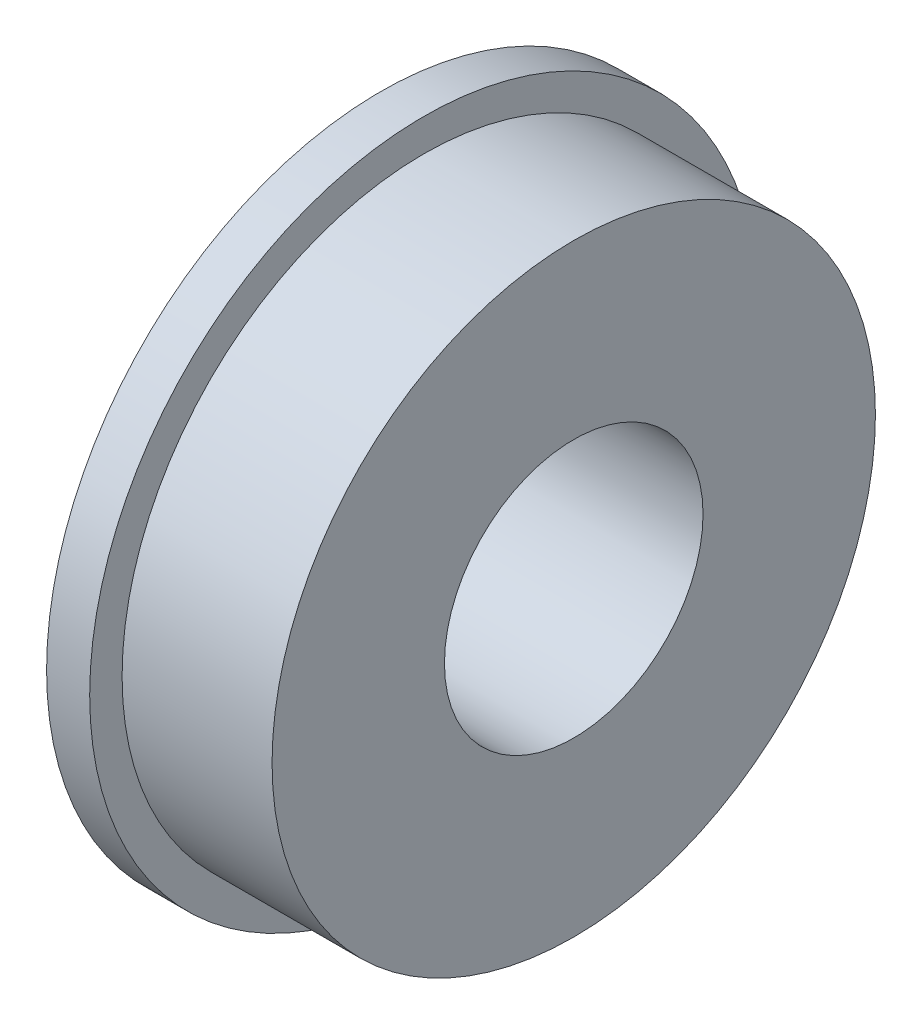
ISO-10303-21;
HEADER;
FILE_DESCRIPTION(('STEP AP214'),'2;1');
FILE_NAME('part.step','',(''),(''),'','','');
FILE_SCHEMA(('AUTOMOTIVE_DESIGN { 1 0 10303 214 1 1 1 1 }'));
ENDSEC;
DATA;
#1=APPLICATION_CONTEXT('core data for automotive mechanical design processes');
#2=APPLICATION_PROTOCOL_DEFINITION('international standard','automotive_design',2000,#1);
#3=PRODUCT_CONTEXT('',#1,'mechanical');
#4=PRODUCT('Part','Part','',(#3));
#5=PRODUCT_RELATED_PRODUCT_CATEGORY('part','',(#4));
#6=PRODUCT_DEFINITION_FORMATION('','',#4);
#7=PRODUCT_DEFINITION_CONTEXT('part definition',#1,'design');
#8=PRODUCT_DEFINITION('design','',#6,#7);
#9=PRODUCT_DEFINITION_SHAPE('','',#8);
#10=(LENGTH_UNIT() NAMED_UNIT(*) SI_UNIT(.MILLI.,.METRE.));
#11=(NAMED_UNIT(*) PLANE_ANGLE_UNIT() SI_UNIT($,.RADIAN.));
#12=(NAMED_UNIT(*) SI_UNIT($,.STERADIAN.) SOLID_ANGLE_UNIT());
#13=UNCERTAINTY_MEASURE_WITH_UNIT(LENGTH_MEASURE(1.E-05),#10,'distance_accuracy_value','');
#14=(GEOMETRIC_REPRESENTATION_CONTEXT(3) GLOBAL_UNCERTAINTY_ASSIGNED_CONTEXT((#13)) GLOBAL_UNIT_ASSIGNED_CONTEXT((#10,
#11,#12)) REPRESENTATION_CONTEXT('',''));
#15=CARTESIAN_POINT('',(0.,0.,0.));
#16=DIRECTION('',(0.,0.,1.));
#17=DIRECTION('',(1.,0.,0.));
#18=AXIS2_PLACEMENT_3D('',#15,#16,#17);
#19=CARTESIAN_POINT('',(0.,0.,0.));
#20=DIRECTION('',(-1.,0.,0.));
#21=DIRECTION('',(0.,0.,1.));
#22=AXIS2_PLACEMENT_3D('',#19,#20,#21);
#23=CYLINDRICAL_SURFACE('',#22,9.906);
#24=CARTESIAN_POINT('',(0.381,0.,0.));
#25=DIRECTION('',(-1.,0.,0.));
#26=DIRECTION('',(0.,0.,1.));
#27=AXIS2_PLACEMENT_3D('',#24,#25,#26);
#28=CIRCLE('',#27,9.906);
#29=CARTESIAN_POINT('',(0.381,0.,9.906));
#30=VERTEX_POINT('',#29);
#31=EDGE_CURVE('E46',#30,#30,#28,.F.);
#32=ORIENTED_EDGE('',*,*,#31,.T.);
#33=EDGE_LOOP('',(#32));
#34=FACE_BOUND('',#33,.T.);
#35=CARTESIAN_POINT('',(0.,0.,0.));
#36=DIRECTION('',(-1.,0.,0.));
#37=DIRECTION('',(0.,0.,1.));
#38=AXIS2_PLACEMENT_3D('',#35,#36,#37);
#39=CIRCLE('',#38,9.906);
#40=CARTESIAN_POINT('',(0.,0.,9.906));
#41=VERTEX_POINT('',#40);
#42=EDGE_CURVE('E18',#41,#41,#39,.T.);
#43=ORIENTED_EDGE('',*,*,#42,.T.);
#44=EDGE_LOOP('',(#43));
#45=FACE_BOUND('',#44,.T.);
#46=ADVANCED_FACE('F15',(#34,#45),#23,.F.);
#47=CARTESIAN_POINT('',(0.,12.3063,0.));
#48=DIRECTION('',(1.,0.,0.));
#49=DIRECTION('',(0.,0.,-1.));
#50=AXIS2_PLACEMENT_3D('',#47,#48,#49);
#51=PLANE('',#50);
#52=CARTESIAN_POINT('',(0.,0.,0.));
#53=DIRECTION('',(-1.,0.,0.));
#54=DIRECTION('',(0.,0.,1.));
#55=AXIS2_PLACEMENT_3D('',#52,#53,#54);
#56=CIRCLE('',#55,12.3063);
#57=CARTESIAN_POINT('',(0.,0.,12.3063));
#58=VERTEX_POINT('',#57);
#59=EDGE_CURVE('E44',#58,#58,#56,.F.);
#60=ORIENTED_EDGE('',*,*,#59,.F.);
#61=EDGE_LOOP('',(#60));
#62=FACE_BOUND('',#61,.T.);
#63=ORIENTED_EDGE('',*,*,#42,.F.);
#64=EDGE_LOOP('',(#63));
#65=FACE_BOUND('',#64,.T.);
#66=ADVANCED_FACE('F54',(#62,#65),#51,.F.);
#67=CARTESIAN_POINT('',(0.381,9.906,0.));
#68=DIRECTION('',(1.,0.,0.));
#69=DIRECTION('',(0.,0.,-1.));
#70=AXIS2_PLACEMENT_3D('',#67,#68,#69);
#71=PLANE('',#70);
#72=ORIENTED_EDGE('',*,*,#31,.F.);
#73=EDGE_LOOP('',(#72));
#74=FACE_BOUND('',#73,.T.);
#75=CARTESIAN_POINT('',(0.381,0.,0.));
#76=DIRECTION('',(-1.,0.,0.));
#77=DIRECTION('',(0.,0.,1.));
#78=AXIS2_PLACEMENT_3D('',#75,#76,#77);
#79=CIRCLE('',#78,6.35);
#80=CARTESIAN_POINT('',(0.381,0.,6.35));
#81=VERTEX_POINT('',#80);
#82=EDGE_CURVE('E41',#81,#81,#79,.T.);
#83=ORIENTED_EDGE('',*,*,#82,.F.);
#84=EDGE_LOOP('',(#83));
#85=FACE_BOUND('',#84,.T.);
#86=ADVANCED_FACE('F56',(#74,#85),#71,.F.);
#87=CARTESIAN_POINT('',(0.,0.,0.));
#88=DIRECTION('',(-1.,0.,0.));
#89=DIRECTION('',(0.,0.,1.));
#90=AXIS2_PLACEMENT_3D('',#87,#88,#89);
#91=CYLINDRICAL_SURFACE('',#90,12.3063);
#92=ORIENTED_EDGE('',*,*,#59,.T.);
#93=EDGE_LOOP('',(#92));
#94=FACE_BOUND('',#93,.T.);
#95=CARTESIAN_POINT('',(1.5875,0.,0.));
#96=DIRECTION('',(-1.,0.,0.));
#97=DIRECTION('',(0.,0.,1.));
#98=AXIS2_PLACEMENT_3D('',#95,#96,#97);
#99=CIRCLE('',#98,12.3063);
#100=CARTESIAN_POINT('',(1.5875,0.,12.3063));
#101=VERTEX_POINT('',#100);
#102=EDGE_CURVE('E38',#101,#101,#99,.T.);
#103=ORIENTED_EDGE('',*,*,#102,.T.);
#104=EDGE_LOOP('',(#103));
#105=FACE_BOUND('',#104,.T.);
#106=ADVANCED_FACE('F63',(#94,#105),#91,.T.);
#107=CARTESIAN_POINT('',(0.,0.,0.));
#108=DIRECTION('',(-1.,0.,0.));
#109=DIRECTION('',(0.,0.,1.));
#110=AXIS2_PLACEMENT_3D('',#107,#108,#109);
#111=CYLINDRICAL_SURFACE('',#110,6.35);
#112=CARTESIAN_POINT('',(0.,0.,0.));
#113=DIRECTION('',(-1.,0.,0.));
#114=DIRECTION('',(0.,0.,1.));
#115=AXIS2_PLACEMENT_3D('',#112,#113,#114);
#116=CIRCLE('',#115,6.35);
#117=CARTESIAN_POINT('',(0.,0.,6.35));
#118=VERTEX_POINT('',#117);
#119=EDGE_CURVE('E35',#118,#118,#116,.F.);
#120=ORIENTED_EDGE('',*,*,#119,.T.);
#121=EDGE_LOOP('',(#120));
#122=FACE_BOUND('',#121,.T.);
#123=ORIENTED_EDGE('',*,*,#82,.T.);
#124=EDGE_LOOP('',(#123));
#125=FACE_BOUND('',#124,.T.);
#126=ADVANCED_FACE('F89',(#122,#125),#111,.T.);
#127=CARTESIAN_POINT('',(1.5875,11.1125,0.));
#128=DIRECTION('',(-1.,0.,0.));
#129=DIRECTION('',(0.,0.,1.));
#130=AXIS2_PLACEMENT_3D('',#127,#128,#129);
#131=PLANE('',#130);
#132=CARTESIAN_POINT('',(1.5875,0.,0.));
#133=DIRECTION('',(-1.,0.,0.));
#134=DIRECTION('',(0.,0.,1.));
#135=AXIS2_PLACEMENT_3D('',#132,#133,#134);
#136=CIRCLE('',#135,11.1125);
#137=CARTESIAN_POINT('',(1.5875,0.,11.1125));
#138=VERTEX_POINT('',#137);
#139=EDGE_CURVE('E32',#138,#138,#136,.F.);
#140=ORIENTED_EDGE('',*,*,#139,.F.);
#141=EDGE_LOOP('',(#140));
#142=FACE_BOUND('',#141,.T.);
#143=ORIENTED_EDGE('',*,*,#102,.F.);
#144=EDGE_LOOP('',(#143));
#145=FACE_BOUND('',#144,.T.);
#146=ADVANCED_FACE('F85',(#142,#145),#131,.F.);
#147=CARTESIAN_POINT('',(0.,6.35,0.));
#148=DIRECTION('',(1.,0.,0.));
#149=DIRECTION('',(0.,0.,-1.));
#150=AXIS2_PLACEMENT_3D('',#147,#148,#149);
#151=PLANE('',#150);
#152=ORIENTED_EDGE('',*,*,#119,.F.);
#153=EDGE_LOOP('',(#152));
#154=FACE_BOUND('',#153,.T.);
#155=CARTESIAN_POINT('',(0.,0.,0.));
#156=DIRECTION('',(-1.,0.,0.));
#157=DIRECTION('',(0.,0.,1.));
#158=AXIS2_PLACEMENT_3D('',#155,#156,#157);
#159=CIRCLE('',#158,4.7625);
#160=CARTESIAN_POINT('',(0.,0.,4.7625));
#161=VERTEX_POINT('',#160);
#162=EDGE_CURVE('E27',#161,#161,#159,.F.);
#163=ORIENTED_EDGE('',*,*,#162,.T.);
#164=EDGE_LOOP('',(#163));
#165=FACE_BOUND('',#164,.T.);
#166=ADVANCED_FACE('F81',(#154,#165),#151,.F.);
#167=CARTESIAN_POINT('',(0.,0.,0.));
#168=DIRECTION('',(-1.,0.,0.));
#169=DIRECTION('',(0.,0.,1.));
#170=AXIS2_PLACEMENT_3D('',#167,#168,#169);
#171=CYLINDRICAL_SURFACE('',#170,11.1125);
#172=ORIENTED_EDGE('',*,*,#139,.T.);
#173=EDGE_LOOP('',(#172));
#174=FACE_BOUND('',#173,.T.);
#175=CARTESIAN_POINT('',(7.112,0.,0.));
#176=DIRECTION('',(-1.,0.,0.));
#177=DIRECTION('',(0.,0.,1.));
#178=AXIS2_PLACEMENT_3D('',#175,#176,#177);
#179=CIRCLE('',#178,11.1125);
#180=CARTESIAN_POINT('',(7.112,0.,11.1125));
#181=VERTEX_POINT('',#180);
#182=EDGE_CURVE('E22',#181,#181,#179,.T.);
#183=ORIENTED_EDGE('',*,*,#182,.T.);
#184=EDGE_LOOP('',(#183));
#185=FACE_BOUND('',#184,.T.);
#186=ADVANCED_FACE('F75',(#174,#185),#171,.T.);
#187=CARTESIAN_POINT('',(0.,0.,0.));
#188=DIRECTION('',(-1.,0.,0.));
#189=DIRECTION('',(0.,0.,1.));
#190=AXIS2_PLACEMENT_3D('',#187,#188,#189);
#191=CYLINDRICAL_SURFACE('',#190,4.7625);
#192=CARTESIAN_POINT('',(7.112,0.,0.));
#193=DIRECTION('',(-1.,0.,0.));
#194=DIRECTION('',(0.,0.,1.));
#195=AXIS2_PLACEMENT_3D('',#192,#193,#194);
#196=CIRCLE('',#195,4.7625);
#197=CARTESIAN_POINT('',(7.112,0.,4.7625));
#198=VERTEX_POINT('',#197);
#199=EDGE_CURVE('E9',#198,#198,#196,.F.);
#200=ORIENTED_EDGE('',*,*,#199,.T.);
#201=EDGE_LOOP('',(#200));
#202=FACE_BOUND('',#201,.T.);
#203=ORIENTED_EDGE('',*,*,#162,.F.);
#204=EDGE_LOOP('',(#203));
#205=FACE_BOUND('',#204,.T.);
#206=ADVANCED_FACE('F69',(#202,#205),#191,.F.);
#207=CARTESIAN_POINT('',(7.112,4.7625,0.));
#208=DIRECTION('',(-1.,0.,0.));
#209=DIRECTION('',(0.,0.,1.));
#210=AXIS2_PLACEMENT_3D('',#207,#208,#209);
#211=PLANE('',#210);
#212=ORIENTED_EDGE('',*,*,#199,.F.);
#213=EDGE_LOOP('',(#212));
#214=FACE_BOUND('',#213,.T.);
#215=ORIENTED_EDGE('',*,*,#182,.F.);
#216=EDGE_LOOP('',(#215));
#217=FACE_BOUND('',#216,.T.);
#218=ADVANCED_FACE('F67',(#214,#217),#211,.F.);
#219=CLOSED_SHELL('',(#46,#66,#86,#106,#126,#146,#166,#186,#206,#218));
#220=MANIFOLD_SOLID_BREP('B1',#219);
#221=ADVANCED_BREP_SHAPE_REPRESENTATION('',(#18,#220),#14);
#222=SHAPE_DEFINITION_REPRESENTATION(#9,#221);
ENDSEC;
END-ISO-10303-21;
